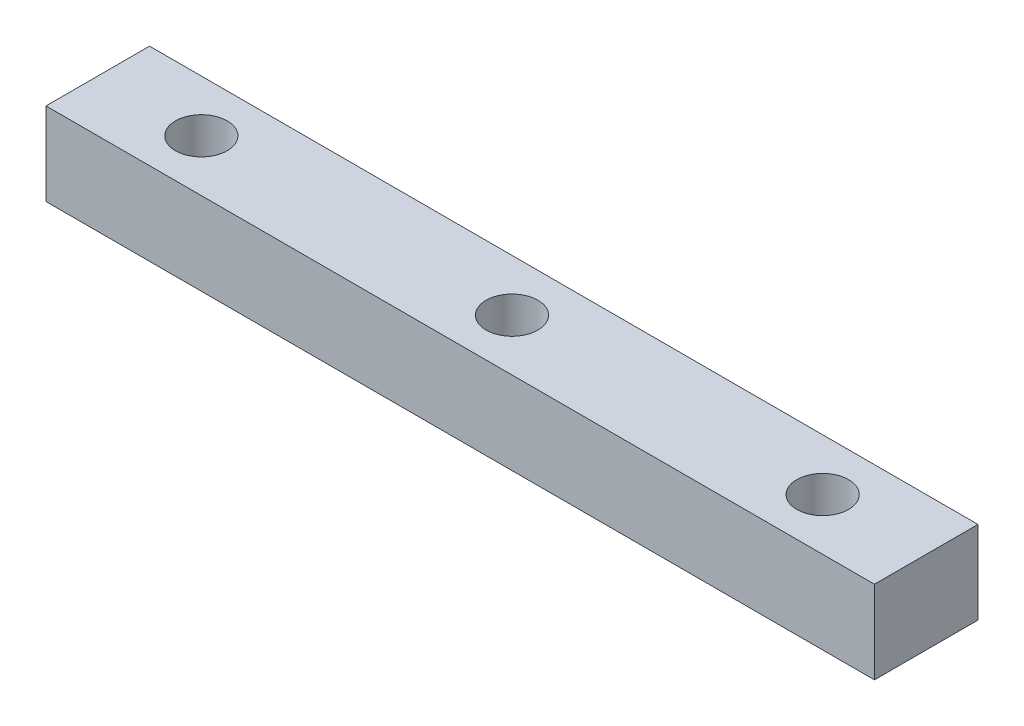
ISO-10303-21;
HEADER;
FILE_DESCRIPTION(('STEP AP214'),'2;1');
FILE_NAME('part.step','',(''),(''),'','','');
FILE_SCHEMA(('AUTOMOTIVE_DESIGN { 1 0 10303 214 1 1 1 1 }'));
ENDSEC;
DATA;
#1=APPLICATION_CONTEXT('core data for automotive mechanical design processes');
#2=APPLICATION_PROTOCOL_DEFINITION('international standard','automotive_design',2000,#1);
#3=PRODUCT_CONTEXT('',#1,'mechanical');
#4=PRODUCT('Part','Part','',(#3));
#5=PRODUCT_RELATED_PRODUCT_CATEGORY('part','',(#4));
#6=PRODUCT_DEFINITION_FORMATION('','',#4);
#7=PRODUCT_DEFINITION_CONTEXT('part definition',#1,'design');
#8=PRODUCT_DEFINITION('design','',#6,#7);
#9=PRODUCT_DEFINITION_SHAPE('','',#8);
#10=(LENGTH_UNIT() NAMED_UNIT(*) SI_UNIT(.MILLI.,.METRE.));
#11=(NAMED_UNIT(*) PLANE_ANGLE_UNIT() SI_UNIT($,.RADIAN.));
#12=(NAMED_UNIT(*) SI_UNIT($,.STERADIAN.) SOLID_ANGLE_UNIT());
#13=UNCERTAINTY_MEASURE_WITH_UNIT(LENGTH_MEASURE(1.E-05),#10,'distance_accuracy_value','');
#14=(GEOMETRIC_REPRESENTATION_CONTEXT(3) GLOBAL_UNCERTAINTY_ASSIGNED_CONTEXT((#13)) GLOBAL_UNIT_ASSIGNED_CONTEXT((#10,
#11,#12)) REPRESENTATION_CONTEXT('',''));
#15=CARTESIAN_POINT('',(0.,0.,0.));
#16=DIRECTION('',(0.,0.,1.));
#17=DIRECTION('',(1.,0.,0.));
#18=AXIS2_PLACEMENT_3D('',#15,#16,#17);
#19=CARTESIAN_POINT('',(0.,4.,0.));
#20=DIRECTION('',(0.,-1.,0.));
#21=DIRECTION('',(0.,0.,-1.));
#22=AXIS2_PLACEMENT_3D('',#19,#20,#21);
#23=PLANE('',#22);
#24=DIRECTION('',(0.,0.,-1.));
#25=VECTOR('',#24,1.);
#26=CARTESIAN_POINT('',(20.,4.,-2.5));
#27=LINE('',#26,#25);
#28=CARTESIAN_POINT('',(20.,4.,2.5));
#29=VERTEX_POINT('',#28);
#30=CARTESIAN_POINT('',(20.,4.,-2.5));
#31=VERTEX_POINT('',#30);
#32=EDGE_CURVE('E94',#29,#31,#27,.T.);
#33=ORIENTED_EDGE('',*,*,#32,.T.);
#34=DIRECTION('',(-1.,0.,0.));
#35=VECTOR('',#34,1.);
#36=CARTESIAN_POINT('',(20.,4.,-2.5));
#37=LINE('',#36,#35);
#38=CARTESIAN_POINT('',(-20.,4.,-2.5));
#39=VERTEX_POINT('',#38);
#40=EDGE_CURVE('E89',#31,#39,#37,.T.);
#41=ORIENTED_EDGE('',*,*,#40,.T.);
#42=DIRECTION('',(0.,0.,1.));
#43=VECTOR('',#42,1.);
#44=CARTESIAN_POINT('',(-20.,4.,-2.5));
#45=LINE('',#44,#43);
#46=CARTESIAN_POINT('',(-20.,4.,2.5));
#47=VERTEX_POINT('',#46);
#48=EDGE_CURVE('E92',#39,#47,#45,.T.);
#49=ORIENTED_EDGE('',*,*,#48,.T.);
#50=DIRECTION('',(1.,0.,0.));
#51=VECTOR('',#50,1.);
#52=CARTESIAN_POINT('',(20.,4.,2.5));
#53=LINE('',#52,#51);
#54=EDGE_CURVE('E59',#47,#29,#53,.T.);
#55=ORIENTED_EDGE('',*,*,#54,.T.);
#56=EDGE_LOOP('',(#33,#41,#49,#55));
#57=FACE_BOUND('',#56,.T.);
#58=CARTESIAN_POINT('',(0.,4.,0.));
#59=DIRECTION('',(0.,1.,0.));
#60=DIRECTION('',(0.,0.,1.));
#61=AXIS2_PLACEMENT_3D('',#58,#59,#60);
#62=CIRCLE('',#61,1.25);
#63=CARTESIAN_POINT('',(0.,4.,1.25));
#64=VERTEX_POINT('',#63);
#65=EDGE_CURVE('E109',#64,#64,#62,.T.);
#66=ORIENTED_EDGE('',*,*,#65,.F.);
#67=EDGE_LOOP('',(#66));
#68=FACE_BOUND('',#67,.T.);
#69=CARTESIAN_POINT('',(15.,4.,0.));
#70=DIRECTION('',(0.,1.,0.));
#71=DIRECTION('',(0.,0.,1.));
#72=AXIS2_PLACEMENT_3D('',#69,#70,#71);
#73=CIRCLE('',#72,1.25);
#74=CARTESIAN_POINT('',(15.,4.,1.25));
#75=VERTEX_POINT('',#74);
#76=EDGE_CURVE('E124',#75,#75,#73,.T.);
#77=ORIENTED_EDGE('',*,*,#76,.F.);
#78=EDGE_LOOP('',(#77));
#79=FACE_BOUND('',#78,.T.);
#80=CARTESIAN_POINT('',(-15.,4.,0.));
#81=DIRECTION('',(0.,1.,0.));
#82=DIRECTION('',(0.,0.,1.));
#83=AXIS2_PLACEMENT_3D('',#80,#81,#82);
#84=CIRCLE('',#83,1.25);
#85=CARTESIAN_POINT('',(-15.,4.,1.25));
#86=VERTEX_POINT('',#85);
#87=EDGE_CURVE('E130',#86,#86,#84,.T.);
#88=ORIENTED_EDGE('',*,*,#87,.F.);
#89=EDGE_LOOP('',(#88));
#90=FACE_BOUND('',#89,.T.);
#91=ADVANCED_FACE('F42',(#57,#68,#79,#90),#23,.F.);
#92=CARTESIAN_POINT('',(0.,0.,0.));
#93=DIRECTION('',(0.,-1.,0.));
#94=DIRECTION('',(0.,0.,-1.));
#95=AXIS2_PLACEMENT_3D('',#92,#93,#94);
#96=PLANE('',#95);
#97=CARTESIAN_POINT('',(15.,0.,0.));
#98=DIRECTION('',(0.,1.,0.));
#99=DIRECTION('',(0.,0.,1.));
#100=AXIS2_PLACEMENT_3D('',#97,#98,#99);
#101=CIRCLE('',#100,1.25);
#102=CARTESIAN_POINT('',(15.,0.,1.25));
#103=VERTEX_POINT('',#102);
#104=EDGE_CURVE('E127',#103,#103,#101,.T.);
#105=ORIENTED_EDGE('',*,*,#104,.T.);
#106=EDGE_LOOP('',(#105));
#107=FACE_BOUND('',#106,.T.);
#108=DIRECTION('',(0.,0.,-1.));
#109=VECTOR('',#108,1.);
#110=CARTESIAN_POINT('',(20.,0.,-2.5));
#111=LINE('',#110,#109);
#112=CARTESIAN_POINT('',(20.,0.,2.5));
#113=VERTEX_POINT('',#112);
#114=CARTESIAN_POINT('',(20.,0.,-2.5));
#115=VERTEX_POINT('',#114);
#116=EDGE_CURVE('E106',#113,#115,#111,.T.);
#117=ORIENTED_EDGE('',*,*,#116,.F.);
#118=DIRECTION('',(1.,0.,0.));
#119=VECTOR('',#118,1.);
#120=CARTESIAN_POINT('',(20.,0.,2.5));
#121=LINE('',#120,#119);
#122=CARTESIAN_POINT('',(-20.,0.,2.5));
#123=VERTEX_POINT('',#122);
#124=EDGE_CURVE('E82',#123,#113,#121,.T.);
#125=ORIENTED_EDGE('',*,*,#124,.F.);
#126=DIRECTION('',(0.,0.,1.));
#127=VECTOR('',#126,1.);
#128=CARTESIAN_POINT('',(-20.,0.,-2.5));
#129=LINE('',#128,#127);
#130=CARTESIAN_POINT('',(-20.,0.,-2.5));
#131=VERTEX_POINT('',#130);
#132=EDGE_CURVE('E76',#131,#123,#129,.T.);
#133=ORIENTED_EDGE('',*,*,#132,.F.);
#134=DIRECTION('',(-1.,0.,0.));
#135=VECTOR('',#134,1.);
#136=CARTESIAN_POINT('',(20.,0.,-2.5));
#137=LINE('',#136,#135);
#138=EDGE_CURVE('E98',#115,#131,#137,.T.);
#139=ORIENTED_EDGE('',*,*,#138,.F.);
#140=EDGE_LOOP('',(#117,#125,#133,#139));
#141=FACE_BOUND('',#140,.T.);
#142=CARTESIAN_POINT('',(0.,0.,0.));
#143=DIRECTION('',(0.,1.,0.));
#144=DIRECTION('',(0.,0.,1.));
#145=AXIS2_PLACEMENT_3D('',#142,#143,#144);
#146=CIRCLE('',#145,1.25);
#147=CARTESIAN_POINT('',(0.,0.,1.25));
#148=VERTEX_POINT('',#147);
#149=EDGE_CURVE('E121',#148,#148,#146,.T.);
#150=ORIENTED_EDGE('',*,*,#149,.T.);
#151=EDGE_LOOP('',(#150));
#152=FACE_BOUND('',#151,.T.);
#153=CARTESIAN_POINT('',(-15.,0.,0.));
#154=DIRECTION('',(0.,1.,0.));
#155=DIRECTION('',(0.,0.,1.));
#156=AXIS2_PLACEMENT_3D('',#153,#154,#155);
#157=CIRCLE('',#156,1.25);
#158=CARTESIAN_POINT('',(-15.,0.,1.25));
#159=VERTEX_POINT('',#158);
#160=EDGE_CURVE('E133',#159,#159,#157,.T.);
#161=ORIENTED_EDGE('',*,*,#160,.T.);
#162=EDGE_LOOP('',(#161));
#163=FACE_BOUND('',#162,.T.);
#164=ADVANCED_FACE('F117',(#107,#141,#152,#163),#96,.T.);
#165=CARTESIAN_POINT('',(20.,4.,-2.5));
#166=DIRECTION('',(-1.,0.,0.));
#167=DIRECTION('',(0.,0.,1.));
#168=AXIS2_PLACEMENT_3D('',#165,#166,#167);
#169=PLANE('',#168);
#170=ORIENTED_EDGE('',*,*,#116,.T.);
#171=DIRECTION('',(0.,-1.,0.));
#172=VECTOR('',#171,1.);
#173=CARTESIAN_POINT('',(20.,4.,-2.5));
#174=LINE('',#173,#172);
#175=EDGE_CURVE('E13',#31,#115,#174,.T.);
#176=ORIENTED_EDGE('',*,*,#175,.F.);
#177=ORIENTED_EDGE('',*,*,#32,.F.);
#178=DIRECTION('',(0.,-1.,0.));
#179=VECTOR('',#178,1.);
#180=CARTESIAN_POINT('',(20.,4.,2.5));
#181=LINE('',#180,#179);
#182=EDGE_CURVE('E102',#29,#113,#181,.T.);
#183=ORIENTED_EDGE('',*,*,#182,.T.);
#184=EDGE_LOOP('',(#170,#176,#177,#183));
#185=FACE_BOUND('',#184,.T.);
#186=ADVANCED_FACE('F44',(#185),#169,.F.);
#187=CARTESIAN_POINT('',(20.,4.,-2.5));
#188=DIRECTION('',(0.,0.,1.));
#189=DIRECTION('',(1.,0.,0.));
#190=AXIS2_PLACEMENT_3D('',#187,#188,#189);
#191=PLANE('',#190);
#192=ORIENTED_EDGE('',*,*,#138,.T.);
#193=DIRECTION('',(0.,-1.,0.));
#194=VECTOR('',#193,1.);
#195=CARTESIAN_POINT('',(-20.,4.,-2.5));
#196=LINE('',#195,#194);
#197=EDGE_CURVE('E51',#39,#131,#196,.T.);
#198=ORIENTED_EDGE('',*,*,#197,.F.);
#199=ORIENTED_EDGE('',*,*,#40,.F.);
#200=ORIENTED_EDGE('',*,*,#175,.T.);
#201=EDGE_LOOP('',(#192,#198,#199,#200));
#202=FACE_BOUND('',#201,.T.);
#203=ADVANCED_FACE('F97',(#202),#191,.F.);
#204=CARTESIAN_POINT('',(-20.,4.,-2.5));
#205=DIRECTION('',(1.,0.,0.));
#206=DIRECTION('',(0.,0.,-1.));
#207=AXIS2_PLACEMENT_3D('',#204,#205,#206);
#208=PLANE('',#207);
#209=ORIENTED_EDGE('',*,*,#132,.T.);
#210=DIRECTION('',(0.,-1.,0.));
#211=VECTOR('',#210,1.);
#212=CARTESIAN_POINT('',(-20.,4.,2.5));
#213=LINE('',#212,#211);
#214=EDGE_CURVE('E99',#47,#123,#213,.T.);
#215=ORIENTED_EDGE('',*,*,#214,.F.);
#216=ORIENTED_EDGE('',*,*,#48,.F.);
#217=ORIENTED_EDGE('',*,*,#197,.T.);
#218=EDGE_LOOP('',(#209,#215,#216,#217));
#219=FACE_BOUND('',#218,.T.);
#220=ADVANCED_FACE('F100',(#219),#208,.F.);
#221=CARTESIAN_POINT('',(20.,4.,2.5));
#222=DIRECTION('',(0.,0.,-1.));
#223=DIRECTION('',(-1.,0.,0.));
#224=AXIS2_PLACEMENT_3D('',#221,#222,#223);
#225=PLANE('',#224);
#226=ORIENTED_EDGE('',*,*,#124,.T.);
#227=ORIENTED_EDGE('',*,*,#182,.F.);
#228=ORIENTED_EDGE('',*,*,#54,.F.);
#229=ORIENTED_EDGE('',*,*,#214,.T.);
#230=EDGE_LOOP('',(#226,#227,#228,#229));
#231=FACE_BOUND('',#230,.T.);
#232=ADVANCED_FACE('F114',(#231),#225,.F.);
#233=CARTESIAN_POINT('',(0.,4.,0.));
#234=DIRECTION('',(0.,-1.,0.));
#235=DIRECTION('',(0.,0.,-1.));
#236=AXIS2_PLACEMENT_3D('',#233,#234,#235);
#237=CYLINDRICAL_SURFACE('',#236,1.25);
#238=ORIENTED_EDGE('',*,*,#65,.T.);
#239=EDGE_LOOP('',(#238));
#240=FACE_BOUND('',#239,.T.);
#241=ORIENTED_EDGE('',*,*,#149,.F.);
#242=EDGE_LOOP('',(#241));
#243=FACE_BOUND('',#242,.T.);
#244=ADVANCED_FACE('F150',(#240,#243),#237,.F.);
#245=CARTESIAN_POINT('',(15.,4.,0.));
#246=DIRECTION('',(0.,-1.,0.));
#247=DIRECTION('',(0.,0.,-1.));
#248=AXIS2_PLACEMENT_3D('',#245,#246,#247);
#249=CYLINDRICAL_SURFACE('',#248,1.25);
#250=ORIENTED_EDGE('',*,*,#76,.T.);
#251=EDGE_LOOP('',(#250));
#252=FACE_BOUND('',#251,.T.);
#253=ORIENTED_EDGE('',*,*,#104,.F.);
#254=EDGE_LOOP('',(#253));
#255=FACE_BOUND('',#254,.T.);
#256=ADVANCED_FACE('F196',(#252,#255),#249,.F.);
#257=CARTESIAN_POINT('',(-15.,4.,0.));
#258=DIRECTION('',(0.,-1.,0.));
#259=DIRECTION('',(0.,0.,-1.));
#260=AXIS2_PLACEMENT_3D('',#257,#258,#259);
#261=CYLINDRICAL_SURFACE('',#260,1.25);
#262=ORIENTED_EDGE('',*,*,#87,.T.);
#263=EDGE_LOOP('',(#262));
#264=FACE_BOUND('',#263,.T.);
#265=ORIENTED_EDGE('',*,*,#160,.F.);
#266=EDGE_LOOP('',(#265));
#267=FACE_BOUND('',#266,.T.);
#268=ADVANCED_FACE('F139',(#264,#267),#261,.F.);
#269=CLOSED_SHELL('',(#91,#164,#186,#203,#220,#232,#244,#256,#268));
#270=MANIFOLD_SOLID_BREP('B2',#269);
#271=ADVANCED_BREP_SHAPE_REPRESENTATION('',(#18,#270),#14);
#272=SHAPE_DEFINITION_REPRESENTATION(#9,#271);
ENDSEC;
END-ISO-10303-21;
